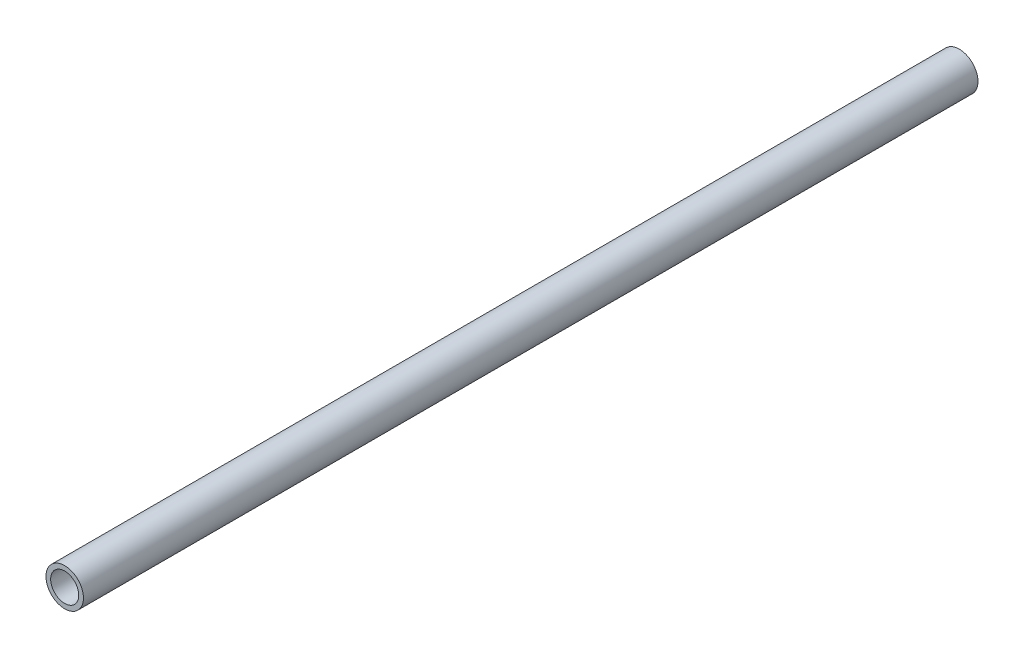
ISO-10303-21;
HEADER;
FILE_DESCRIPTION(('STEP AP214'),'2;1');
FILE_NAME('part.step','',(''),(''),'','','');
FILE_SCHEMA(('AUTOMOTIVE_DESIGN { 1 0 10303 214 1 1 1 1 }'));
ENDSEC;
DATA;
#1=APPLICATION_CONTEXT('core data for automotive mechanical design processes');
#2=APPLICATION_PROTOCOL_DEFINITION('international standard','automotive_design',2000,#1);
#3=PRODUCT_CONTEXT('',#1,'mechanical');
#4=PRODUCT('Part','Part','',(#3));
#5=PRODUCT_RELATED_PRODUCT_CATEGORY('part','',(#4));
#6=PRODUCT_DEFINITION_FORMATION('','',#4);
#7=PRODUCT_DEFINITION_CONTEXT('part definition',#1,'design');
#8=PRODUCT_DEFINITION('design','',#6,#7);
#9=PRODUCT_DEFINITION_SHAPE('','',#8);
#10=(LENGTH_UNIT() NAMED_UNIT(*) SI_UNIT(.MILLI.,.METRE.));
#11=(NAMED_UNIT(*) PLANE_ANGLE_UNIT() SI_UNIT($,.RADIAN.));
#12=(NAMED_UNIT(*) SI_UNIT($,.STERADIAN.) SOLID_ANGLE_UNIT());
#13=UNCERTAINTY_MEASURE_WITH_UNIT(LENGTH_MEASURE(1.E-05),#10,'distance_accuracy_value','');
#14=(GEOMETRIC_REPRESENTATION_CONTEXT(3) GLOBAL_UNCERTAINTY_ASSIGNED_CONTEXT((#13)) GLOBAL_UNIT_ASSIGNED_CONTEXT((#10,
#11,#12)) REPRESENTATION_CONTEXT('',''));
#15=CARTESIAN_POINT('',(0.,0.,0.));
#16=DIRECTION('',(0.,0.,1.));
#17=DIRECTION('',(1.,0.,0.));
#18=AXIS2_PLACEMENT_3D('',#15,#16,#17);
#19=CARTESIAN_POINT('',(0.,0.,382.));
#20=DIRECTION('',(0.,0.,1.));
#21=DIRECTION('',(1.,0.,0.));
#22=AXIS2_PLACEMENT_3D('',#19,#20,#21);
#23=PLANE('',#22);
#24=CARTESIAN_POINT('',(0.,0.,382.));
#25=DIRECTION('',(0.,0.,1.));
#26=DIRECTION('',(1.,0.,0.));
#27=AXIS2_PLACEMENT_3D('',#24,#25,#26);
#28=CIRCLE('',#27,8.);
#29=CARTESIAN_POINT('',(8.,0.,382.));
#30=VERTEX_POINT('',#29);
#31=EDGE_CURVE('E10',#30,#30,#28,.T.);
#32=ORIENTED_EDGE('',*,*,#31,.T.);
#33=EDGE_LOOP('',(#32));
#34=FACE_BOUND('',#33,.T.);
#35=CARTESIAN_POINT('',(0.,0.,382.));
#36=DIRECTION('',(0.,0.,1.));
#37=DIRECTION('',(1.,0.,0.));
#38=AXIS2_PLACEMENT_3D('',#35,#36,#37);
#39=CIRCLE('',#38,6.);
#40=CARTESIAN_POINT('',(6.,0.,382.));
#41=VERTEX_POINT('',#40);
#42=EDGE_CURVE('E43',#41,#41,#39,.T.);
#43=ORIENTED_EDGE('',*,*,#42,.F.);
#44=EDGE_LOOP('',(#43));
#45=FACE_BOUND('',#44,.T.);
#46=ADVANCED_FACE('F32',(#34,#45),#23,.T.);
#47=CARTESIAN_POINT('',(0.,0.,0.));
#48=DIRECTION('',(0.,0.,1.));
#49=DIRECTION('',(1.,0.,0.));
#50=AXIS2_PLACEMENT_3D('',#47,#48,#49);
#51=PLANE('',#50);
#52=CARTESIAN_POINT('',(0.,0.,0.));
#53=DIRECTION('',(0.,0.,1.));
#54=DIRECTION('',(1.,0.,0.));
#55=AXIS2_PLACEMENT_3D('',#52,#53,#54);
#56=CIRCLE('',#55,8.);
#57=CARTESIAN_POINT('',(8.,0.,0.));
#58=VERTEX_POINT('',#57);
#59=EDGE_CURVE('E36',#58,#58,#56,.T.);
#60=ORIENTED_EDGE('',*,*,#59,.F.);
#61=EDGE_LOOP('',(#60));
#62=FACE_BOUND('',#61,.T.);
#63=CARTESIAN_POINT('',(0.,0.,0.));
#64=DIRECTION('',(0.,0.,1.));
#65=DIRECTION('',(1.,0.,0.));
#66=AXIS2_PLACEMENT_3D('',#63,#64,#65);
#67=CIRCLE('',#66,6.);
#68=CARTESIAN_POINT('',(6.,0.,0.));
#69=VERTEX_POINT('',#68);
#70=EDGE_CURVE('E45',#69,#69,#67,.T.);
#71=ORIENTED_EDGE('',*,*,#70,.T.);
#72=EDGE_LOOP('',(#71));
#73=FACE_BOUND('',#72,.T.);
#74=ADVANCED_FACE('F55',(#62,#73),#51,.F.);
#75=CARTESIAN_POINT('',(0.,0.,382.));
#76=DIRECTION('',(0.,0.,-1.));
#77=DIRECTION('',(-1.,0.,0.));
#78=AXIS2_PLACEMENT_3D('',#75,#76,#77);
#79=CYLINDRICAL_SURFACE('',#78,8.);
#80=ORIENTED_EDGE('',*,*,#31,.F.);
#81=EDGE_LOOP('',(#80));
#82=FACE_BOUND('',#81,.T.);
#83=ORIENTED_EDGE('',*,*,#59,.T.);
#84=EDGE_LOOP('',(#83));
#85=FACE_BOUND('',#84,.T.);
#86=ADVANCED_FACE('F34',(#82,#85),#79,.T.);
#87=CARTESIAN_POINT('',(0.,0.,382.));
#88=DIRECTION('',(0.,0.,-1.));
#89=DIRECTION('',(-1.,0.,0.));
#90=AXIS2_PLACEMENT_3D('',#87,#88,#89);
#91=CYLINDRICAL_SURFACE('',#90,6.);
#92=ORIENTED_EDGE('',*,*,#42,.T.);
#93=EDGE_LOOP('',(#92));
#94=FACE_BOUND('',#93,.T.);
#95=ORIENTED_EDGE('',*,*,#70,.F.);
#96=EDGE_LOOP('',(#95));
#97=FACE_BOUND('',#96,.T.);
#98=ADVANCED_FACE('F51',(#94,#97),#91,.F.);
#99=CLOSED_SHELL('',(#46,#74,#86,#98));
#100=MANIFOLD_SOLID_BREP('B2',#99);
#101=ADVANCED_BREP_SHAPE_REPRESENTATION('',(#18,#100),#14);
#102=SHAPE_DEFINITION_REPRESENTATION(#9,#101);
ENDSEC;
END-ISO-10303-21;
